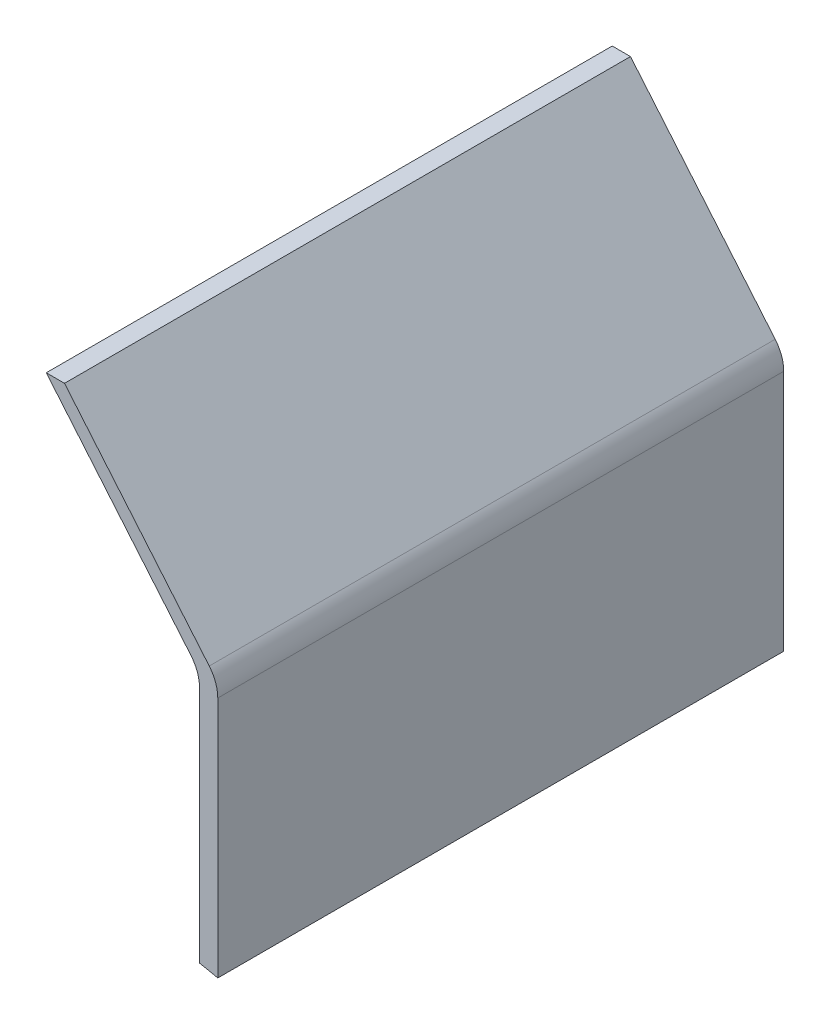
ISO-10303-21;
HEADER;
FILE_DESCRIPTION(('STEP AP214'),'2;1');
FILE_NAME('part.step','',(''),(''),'','','');
FILE_SCHEMA(('AUTOMOTIVE_DESIGN { 1 0 10303 214 1 1 1 1 }'));
ENDSEC;
DATA;
#1=APPLICATION_CONTEXT('core data for automotive mechanical design processes');
#2=APPLICATION_PROTOCOL_DEFINITION('international standard','automotive_design',2000,#1);
#3=PRODUCT_CONTEXT('',#1,'mechanical');
#4=PRODUCT('Part','Part','',(#3));
#5=PRODUCT_RELATED_PRODUCT_CATEGORY('part','',(#4));
#6=PRODUCT_DEFINITION_FORMATION('','',#4);
#7=PRODUCT_DEFINITION_CONTEXT('part definition',#1,'design');
#8=PRODUCT_DEFINITION('design','',#6,#7);
#9=PRODUCT_DEFINITION_SHAPE('','',#8);
#10=(LENGTH_UNIT() NAMED_UNIT(*) SI_UNIT(.MILLI.,.METRE.));
#11=(NAMED_UNIT(*) PLANE_ANGLE_UNIT() SI_UNIT($,.RADIAN.));
#12=(NAMED_UNIT(*) SI_UNIT($,.STERADIAN.) SOLID_ANGLE_UNIT());
#13=UNCERTAINTY_MEASURE_WITH_UNIT(LENGTH_MEASURE(1.E-05),#10,'distance_accuracy_value','');
#14=(GEOMETRIC_REPRESENTATION_CONTEXT(3) GLOBAL_UNCERTAINTY_ASSIGNED_CONTEXT((#13)) GLOBAL_UNIT_ASSIGNED_CONTEXT((#10,
#11,#12)) REPRESENTATION_CONTEXT('',''));
#15=CARTESIAN_POINT('',(0.,0.,0.));
#16=DIRECTION('',(0.,0.,1.));
#17=DIRECTION('',(1.,0.,0.));
#18=AXIS2_PLACEMENT_3D('',#15,#16,#17);
#19=CARTESIAN_POINT('',(-35.,-156.12494995996,155.));
#20=DIRECTION('',(0.,0.,-1.));
#21=DIRECTION('',(-1.,0.,0.));
#22=AXIS2_PLACEMENT_3D('',#19,#20,#21);
#23=CYLINDRICAL_SURFACE('',#22,160.);
#24=CARTESIAN_POINT('',(-35.,-156.12494995996,0.));
#25=DIRECTION('',(0.,0.,-1.));
#26=DIRECTION('',(1.,0.,0.));
#27=AXIS2_PLACEMENT_3D('',#24,#25,#26);
#28=CIRCLE('',#27,160.);
#29=CARTESIAN_POINT('',(-4.99999999999999,1.03738649505716,0.));
#30=VERTEX_POINT('',#29);
#31=CARTESIAN_POINT('',(0.,0.,0.));
#32=VERTEX_POINT('',#31);
#33=EDGE_CURVE('E121',#30,#32,#28,.T.);
#34=ORIENTED_EDGE('',*,*,#33,.T.);
#35=DIRECTION('',(0.,0.,-1.));
#36=VECTOR('',#35,1.);
#37=CARTESIAN_POINT('',(0.,0.,155.));
#38=LINE('',#37,#36);
#39=CARTESIAN_POINT('',(0.,0.,155.));
#40=VERTEX_POINT('',#39);
#41=EDGE_CURVE('E104',#40,#32,#38,.T.);
#42=ORIENTED_EDGE('',*,*,#41,.F.);
#43=CARTESIAN_POINT('',(-35.,-156.12494995996,155.));
#44=DIRECTION('',(0.,0.,-1.));
#45=DIRECTION('',(1.,0.,0.));
#46=AXIS2_PLACEMENT_3D('',#43,#44,#45);
#47=CIRCLE('',#46,160.);
#48=CARTESIAN_POINT('',(-4.99999999999999,1.03738649505716,155.));
#49=VERTEX_POINT('',#48);
#50=EDGE_CURVE('E110',#49,#40,#47,.T.);
#51=ORIENTED_EDGE('',*,*,#50,.F.);
#52=DIRECTION('',(0.,0.,-1.));
#53=VECTOR('',#52,1.);
#54=CARTESIAN_POINT('',(-4.99999999999999,1.03738649505716,155.));
#55=LINE('',#54,#53);
#56=EDGE_CURVE('E156',#49,#30,#55,.T.);
#57=ORIENTED_EDGE('',*,*,#56,.T.);
#58=EDGE_LOOP('',(#34,#42,#51,#57));
#59=FACE_BOUND('',#58,.T.);
#60=ADVANCED_FACE('F34',(#59),#23,.F.);
#61=CARTESIAN_POINT('',(0.,70.0373864950572,155.));
#62=DIRECTION('',(-1.,0.,0.));
#63=DIRECTION('',(0.,-1.,0.));
#64=AXIS2_PLACEMENT_3D('',#61,#62,#63);
#65=PLANE('',#64);
#66=DIRECTION('',(0.,1.,0.));
#67=VECTOR('',#66,1.);
#68=CARTESIAN_POINT('',(0.,70.0373864950572,0.));
#69=LINE('',#68,#67);
#70=CARTESIAN_POINT('',(0.,66.3976841523951,0.));
#71=VERTEX_POINT('',#70);
#72=EDGE_CURVE('E165',#32,#71,#69,.T.);
#73=ORIENTED_EDGE('',*,*,#72,.T.);
#74=DIRECTION('',(0.,0.,-1.));
#75=VECTOR('',#74,1.);
#76=CARTESIAN_POINT('',(0.,66.3976841523951,155.));
#77=LINE('',#76,#75);
#78=CARTESIAN_POINT('',(0.,66.3976841523951,155.));
#79=VERTEX_POINT('',#78);
#80=EDGE_CURVE('E107',#71,#79,#77,.F.);
#81=ORIENTED_EDGE('',*,*,#80,.T.);
#82=DIRECTION('',(0.,1.,0.));
#83=VECTOR('',#82,1.);
#84=CARTESIAN_POINT('',(0.,70.0373864950572,155.));
#85=LINE('',#84,#83);
#86=EDGE_CURVE('E99',#40,#79,#85,.T.);
#87=ORIENTED_EDGE('',*,*,#86,.F.);
#88=ORIENTED_EDGE('',*,*,#41,.T.);
#89=EDGE_LOOP('',(#73,#81,#87,#88));
#90=FACE_BOUND('',#89,.T.);
#91=ADVANCED_FACE('F102',(#90),#65,.F.);
#92=CARTESIAN_POINT('',(-41.9740309125311,120.060088630726,155.));
#93=DIRECTION('',(-0.766044443118977,-0.64278760968654,0.));
#94=DIRECTION('',(0.64278760968654,-0.766044443118977,0.));
#95=AXIS2_PLACEMENT_3D('',#92,#93,#94);
#96=PLANE('',#95);
#97=DIRECTION('',(-0.64278760968654,0.766044443118977,0.));
#98=VECTOR('',#97,1.);
#99=CARTESIAN_POINT('',(-41.9740309125311,120.060088630726,155.));
#100=LINE('',#99,#98);
#101=CARTESIAN_POINT('',(-2.33955556881023,72.8255602492605,155.));
#102=VERTEX_POINT('',#101);
#103=CARTESIAN_POINT('',(-41.9740309125311,120.060088630726,155.));
#104=VERTEX_POINT('',#103);
#105=EDGE_CURVE('E109',#102,#104,#100,.T.);
#106=ORIENTED_EDGE('',*,*,#105,.F.);
#107=DIRECTION('',(0.,0.,-1.));
#108=VECTOR('',#107,1.);
#109=CARTESIAN_POINT('',(-2.33955556881022,72.8255602492605,155.));
#110=LINE('',#109,#108);
#111=CARTESIAN_POINT('',(-2.33955556881023,72.8255602492605,0.));
#112=VERTEX_POINT('',#111);
#113=EDGE_CURVE('E122',#102,#112,#110,.T.);
#114=ORIENTED_EDGE('',*,*,#113,.T.);
#115=DIRECTION('',(-0.64278760968654,0.766044443118977,0.));
#116=VECTOR('',#115,1.);
#117=CARTESIAN_POINT('',(-41.9740309125311,120.060088630726,0.));
#118=LINE('',#117,#116);
#119=CARTESIAN_POINT('',(-41.9740309125311,120.060088630726,0.));
#120=VERTEX_POINT('',#119);
#121=EDGE_CURVE('E167',#112,#120,#118,.T.);
#122=ORIENTED_EDGE('',*,*,#121,.T.);
#123=DIRECTION('',(0.,0.,-1.));
#124=VECTOR('',#123,1.);
#125=CARTESIAN_POINT('',(-41.9740309125311,120.060088630726,155.));
#126=LINE('',#125,#124);
#127=EDGE_CURVE('E123',#104,#120,#126,.T.);
#128=ORIENTED_EDGE('',*,*,#127,.F.);
#129=EDGE_LOOP('',(#106,#114,#122,#128));
#130=FACE_BOUND('',#129,.T.);
#131=ADVANCED_FACE('F176',(#130),#96,.F.);
#132=CARTESIAN_POINT('',(-46.9740309125311,120.060088630726,155.));
#133=DIRECTION('',(0.,-1.,0.));
#134=DIRECTION('',(1.,0.,0.));
#135=AXIS2_PLACEMENT_3D('',#132,#133,#134);
#136=PLANE('',#135);
#137=DIRECTION('',(-1.,0.,0.));
#138=VECTOR('',#137,1.);
#139=CARTESIAN_POINT('',(-46.9740309125311,120.060088630726,0.));
#140=LINE('',#139,#138);
#141=CARTESIAN_POINT('',(-46.9740309125311,120.060088630726,0.));
#142=VERTEX_POINT('',#141);
#143=EDGE_CURVE('E152',#120,#142,#140,.T.);
#144=ORIENTED_EDGE('',*,*,#143,.T.);
#145=DIRECTION('',(0.,0.,-1.));
#146=VECTOR('',#145,1.);
#147=CARTESIAN_POINT('',(-46.9740309125311,120.060088630726,155.));
#148=LINE('',#147,#146);
#149=CARTESIAN_POINT('',(-46.9740309125311,120.060088630726,155.));
#150=VERTEX_POINT('',#149);
#151=EDGE_CURVE('E129',#150,#142,#148,.T.);
#152=ORIENTED_EDGE('',*,*,#151,.F.);
#153=DIRECTION('',(-1.,0.,0.));
#154=VECTOR('',#153,1.);
#155=CARTESIAN_POINT('',(-46.9740309125311,120.060088630726,155.));
#156=LINE('',#155,#154);
#157=EDGE_CURVE('E160',#104,#150,#156,.T.);
#158=ORIENTED_EDGE('',*,*,#157,.F.);
#159=ORIENTED_EDGE('',*,*,#127,.T.);
#160=EDGE_LOOP('',(#144,#152,#158,#159));
#161=FACE_BOUND('',#160,.T.);
#162=ADVANCED_FACE('F171',(#161),#136,.F.);
#163=CARTESIAN_POINT('',(-4.99999999999999,70.0373864950572,155.));
#164=DIRECTION('',(0.766044443118977,0.64278760968654,0.));
#165=DIRECTION('',(-0.64278760968654,0.766044443118977,0.));
#166=AXIS2_PLACEMENT_3D('',#163,#164,#165);
#167=PLANE('',#166);
#168=DIRECTION('',(0.64278760968654,-0.766044443118977,0.));
#169=VECTOR('',#168,1.);
#170=CARTESIAN_POINT('',(-4.99999999999999,70.0373864950572,0.));
#171=LINE('',#170,#169);
#172=CARTESIAN_POINT('',(-7.33955556881022,72.8255602492605,0.));
#173=VERTEX_POINT('',#172);
#174=EDGE_CURVE('E146',#142,#173,#171,.T.);
#175=ORIENTED_EDGE('',*,*,#174,.T.);
#176=DIRECTION('',(0.,0.,-1.));
#177=VECTOR('',#176,1.);
#178=CARTESIAN_POINT('',(-7.33955556881022,72.8255602492605,155.));
#179=LINE('',#178,#177);
#180=CARTESIAN_POINT('',(-7.33955556881022,72.8255602492605,155.));
#181=VERTEX_POINT('',#180);
#182=EDGE_CURVE('E55',#173,#181,#179,.F.);
#183=ORIENTED_EDGE('',*,*,#182,.T.);
#184=DIRECTION('',(0.64278760968654,-0.766044443118977,0.));
#185=VECTOR('',#184,1.);
#186=CARTESIAN_POINT('',(-4.99999999999999,70.0373864950572,155.));
#187=LINE('',#186,#185);
#188=EDGE_CURVE('E157',#150,#181,#187,.T.);
#189=ORIENTED_EDGE('',*,*,#188,.F.);
#190=ORIENTED_EDGE('',*,*,#151,.T.);
#191=EDGE_LOOP('',(#175,#183,#189,#190));
#192=FACE_BOUND('',#191,.T.);
#193=ADVANCED_FACE('F150',(#192),#167,.F.);
#194=CARTESIAN_POINT('',(-4.99999999999999,1.03738649505716,155.));
#195=DIRECTION('',(1.,0.,0.));
#196=DIRECTION('',(0.,1.,0.));
#197=AXIS2_PLACEMENT_3D('',#194,#195,#196);
#198=PLANE('',#197);
#199=DIRECTION('',(0.,-1.,0.));
#200=VECTOR('',#199,1.);
#201=CARTESIAN_POINT('',(-4.99999999999999,1.03738649505716,155.));
#202=LINE('',#201,#200);
#203=CARTESIAN_POINT('',(-4.99999999999999,66.3976841523951,155.));
#204=VERTEX_POINT('',#203);
#205=EDGE_CURVE('E114',#204,#49,#202,.T.);
#206=ORIENTED_EDGE('',*,*,#205,.F.);
#207=DIRECTION('',(0.,0.,-1.));
#208=VECTOR('',#207,1.);
#209=CARTESIAN_POINT('',(-4.99999999999999,66.3976841523951,0.));
#210=LINE('',#209,#208);
#211=CARTESIAN_POINT('',(-4.99999999999999,66.3976841523951,0.));
#212=VERTEX_POINT('',#211);
#213=EDGE_CURVE('E137',#204,#212,#210,.T.);
#214=ORIENTED_EDGE('',*,*,#213,.T.);
#215=DIRECTION('',(0.,-1.,0.));
#216=VECTOR('',#215,1.);
#217=CARTESIAN_POINT('',(-4.99999999999999,1.03738649505716,0.));
#218=LINE('',#217,#216);
#219=EDGE_CURVE('E118',#212,#30,#218,.T.);
#220=ORIENTED_EDGE('',*,*,#219,.T.);
#221=ORIENTED_EDGE('',*,*,#56,.F.);
#222=EDGE_LOOP('',(#206,#214,#220,#221));
#223=FACE_BOUND('',#222,.T.);
#224=ADVANCED_FACE('F155',(#223),#198,.F.);
#225=CARTESIAN_POINT('',(-35.,-156.12494995996,155.));
#226=DIRECTION('',(0.,0.,1.));
#227=DIRECTION('',(1.,0.,0.));
#228=AXIS2_PLACEMENT_3D('',#225,#226,#227);
#229=PLANE('',#228);
#230=ORIENTED_EDGE('',*,*,#86,.T.);
#231=CARTESIAN_POINT('',(-10.,66.3976841523951,155.));
#232=DIRECTION('',(0.,0.,1.));
#233=DIRECTION('',(1.,0.,0.));
#234=AXIS2_PLACEMENT_3D('',#231,#232,#233);
#235=CIRCLE('',#234,10.);
#236=EDGE_CURVE('E135',#79,#102,#235,.T.);
#237=ORIENTED_EDGE('',*,*,#236,.T.);
#238=ORIENTED_EDGE('',*,*,#105,.T.);
#239=ORIENTED_EDGE('',*,*,#157,.T.);
#240=ORIENTED_EDGE('',*,*,#188,.T.);
#241=CARTESIAN_POINT('',(-15.,66.3976841523951,155.));
#242=DIRECTION('',(0.,0.,1.));
#243=DIRECTION('',(1.,0.,0.));
#244=AXIS2_PLACEMENT_3D('',#241,#242,#243);
#245=CIRCLE('',#244,10.);
#246=EDGE_CURVE('E11',#181,#204,#245,.F.);
#247=ORIENTED_EDGE('',*,*,#246,.T.);
#248=ORIENTED_EDGE('',*,*,#205,.T.);
#249=ORIENTED_EDGE('',*,*,#50,.T.);
#250=EDGE_LOOP('',(#230,#237,#238,#239,#240,#247,#248,#249));
#251=FACE_BOUND('',#250,.T.);
#252=ADVANCED_FACE('F113',(#251),#229,.T.);
#253=CARTESIAN_POINT('',(-35.,-156.12494995996,0.));
#254=DIRECTION('',(0.,0.,1.));
#255=DIRECTION('',(1.,0.,0.));
#256=AXIS2_PLACEMENT_3D('',#253,#254,#255);
#257=PLANE('',#256);
#258=ORIENTED_EDGE('',*,*,#121,.F.);
#259=CARTESIAN_POINT('',(-10.,66.3976841523951,0.));
#260=DIRECTION('',(0.,0.,1.));
#261=DIRECTION('',(1.,0.,0.));
#262=AXIS2_PLACEMENT_3D('',#259,#260,#261);
#263=CIRCLE('',#262,10.);
#264=EDGE_CURVE('E126',#112,#71,#263,.F.);
#265=ORIENTED_EDGE('',*,*,#264,.T.);
#266=ORIENTED_EDGE('',*,*,#72,.F.);
#267=ORIENTED_EDGE('',*,*,#33,.F.);
#268=ORIENTED_EDGE('',*,*,#219,.F.);
#269=CARTESIAN_POINT('',(-15.,66.3976841523951,0.));
#270=DIRECTION('',(0.,0.,1.));
#271=DIRECTION('',(1.,0.,0.));
#272=AXIS2_PLACEMENT_3D('',#269,#270,#271);
#273=CIRCLE('',#272,10.);
#274=EDGE_CURVE('E42',#212,#173,#273,.T.);
#275=ORIENTED_EDGE('',*,*,#274,.T.);
#276=ORIENTED_EDGE('',*,*,#174,.F.);
#277=ORIENTED_EDGE('',*,*,#143,.F.);
#278=EDGE_LOOP('',(#258,#265,#266,#267,#268,#275,#276,#277));
#279=FACE_BOUND('',#278,.T.);
#280=ADVANCED_FACE('F144',(#279),#257,.F.);
#281=CARTESIAN_POINT('',(-10.,66.3976841523951,155.));
#282=DIRECTION('',(0.,0.,-1.));
#283=DIRECTION('',(-1.,0.,0.));
#284=AXIS2_PLACEMENT_3D('',#281,#282,#283);
#285=CYLINDRICAL_SURFACE('',#284,10.);
#286=ORIENTED_EDGE('',*,*,#236,.F.);
#287=ORIENTED_EDGE('',*,*,#80,.F.);
#288=ORIENTED_EDGE('',*,*,#264,.F.);
#289=ORIENTED_EDGE('',*,*,#113,.F.);
#290=EDGE_LOOP('',(#286,#287,#288,#289));
#291=FACE_BOUND('',#290,.T.);
#292=ADVANCED_FACE('F179',(#291),#285,.T.);
#293=CARTESIAN_POINT('',(-15.,66.3976841523951,155.));
#294=DIRECTION('',(0.,0.,1.));
#295=DIRECTION('',(1.,0.,0.));
#296=AXIS2_PLACEMENT_3D('',#293,#294,#295);
#297=CYLINDRICAL_SURFACE('',#296,10.);
#298=ORIENTED_EDGE('',*,*,#246,.F.);
#299=ORIENTED_EDGE('',*,*,#182,.F.);
#300=ORIENTED_EDGE('',*,*,#274,.F.);
#301=ORIENTED_EDGE('',*,*,#213,.F.);
#302=EDGE_LOOP('',(#298,#299,#300,#301));
#303=FACE_BOUND('',#302,.T.);
#304=ADVANCED_FACE('F36',(#303),#297,.F.);
#305=CLOSED_SHELL('',(#60,#91,#131,#162,#193,#224,#252,#280,#292,#304));
#306=MANIFOLD_SOLID_BREP('B2',#305);
#307=ADVANCED_BREP_SHAPE_REPRESENTATION('',(#18,#306),#14);
#308=SHAPE_DEFINITION_REPRESENTATION(#9,#307);
ENDSEC;
END-ISO-10303-21;
